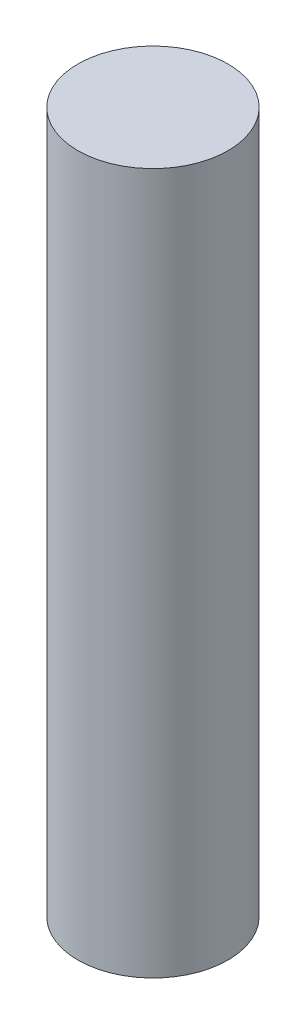
ISO-10303-21;
HEADER;
FILE_DESCRIPTION(('STEP AP214'),'2;1');
FILE_NAME('part.step','',(''),(''),'','','');
FILE_SCHEMA(('AUTOMOTIVE_DESIGN { 1 0 10303 214 1 1 1 1 }'));
ENDSEC;
DATA;
#1=APPLICATION_CONTEXT('core data for automotive mechanical design processes');
#2=APPLICATION_PROTOCOL_DEFINITION('international standard','automotive_design',2000,#1);
#3=PRODUCT_CONTEXT('',#1,'mechanical');
#4=PRODUCT('Part','Part','',(#3));
#5=PRODUCT_RELATED_PRODUCT_CATEGORY('part','',(#4));
#6=PRODUCT_DEFINITION_FORMATION('','',#4);
#7=PRODUCT_DEFINITION_CONTEXT('part definition',#1,'design');
#8=PRODUCT_DEFINITION('design','',#6,#7);
#9=PRODUCT_DEFINITION_SHAPE('','',#8);
#10=(LENGTH_UNIT() NAMED_UNIT(*) SI_UNIT(.MILLI.,.METRE.));
#11=(NAMED_UNIT(*) PLANE_ANGLE_UNIT() SI_UNIT($,.RADIAN.));
#12=(NAMED_UNIT(*) SI_UNIT($,.STERADIAN.) SOLID_ANGLE_UNIT());
#13=UNCERTAINTY_MEASURE_WITH_UNIT(LENGTH_MEASURE(1.E-05),#10,'distance_accuracy_value','');
#14=(GEOMETRIC_REPRESENTATION_CONTEXT(3) GLOBAL_UNCERTAINTY_ASSIGNED_CONTEXT((#13)) GLOBAL_UNIT_ASSIGNED_CONTEXT((#10,
#11,#12)) REPRESENTATION_CONTEXT('',''));
#15=CARTESIAN_POINT('',(0.,0.,0.));
#16=DIRECTION('',(0.,0.,1.));
#17=DIRECTION('',(1.,0.,0.));
#18=AXIS2_PLACEMENT_3D('',#15,#16,#17);
#19=CARTESIAN_POINT('',(0.,612.5,0.));
#20=DIRECTION('',(0.,-1.,0.));
#21=DIRECTION('',(0.,0.,-1.));
#22=AXIS2_PLACEMENT_3D('',#19,#20,#21);
#23=CYLINDRICAL_SURFACE('',#22,56.25);
#24=CARTESIAN_POINT('',(0.,612.5,0.));
#25=DIRECTION('',(0.,1.,0.));
#26=DIRECTION('',(0.,0.,1.));
#27=AXIS2_PLACEMENT_3D('',#24,#25,#26);
#28=CIRCLE('',#27,56.25);
#29=CARTESIAN_POINT('',(0.,612.5,56.25));
#30=VERTEX_POINT('',#29);
#31=EDGE_CURVE('E10',#30,#30,#28,.T.);
#32=ORIENTED_EDGE('',*,*,#31,.F.);
#33=EDGE_LOOP('',(#32));
#34=FACE_BOUND('',#33,.T.);
#35=CARTESIAN_POINT('',(0.,87.5,0.));
#36=DIRECTION('',(0.,1.,0.));
#37=DIRECTION('',(0.,0.,1.));
#38=AXIS2_PLACEMENT_3D('',#35,#36,#37);
#39=CIRCLE('',#38,56.25);
#40=CARTESIAN_POINT('',(0.,87.5,56.25));
#41=VERTEX_POINT('',#40);
#42=EDGE_CURVE('E37',#41,#41,#39,.T.);
#43=ORIENTED_EDGE('',*,*,#42,.T.);
#44=EDGE_LOOP('',(#43));
#45=FACE_BOUND('',#44,.T.);
#46=ADVANCED_FACE('F34',(#34,#45),#23,.T.);
#47=CARTESIAN_POINT('',(0.,612.5,0.));
#48=DIRECTION('',(0.,1.,0.));
#49=DIRECTION('',(0.,0.,1.));
#50=AXIS2_PLACEMENT_3D('',#47,#48,#49);
#51=PLANE('',#50);
#52=ORIENTED_EDGE('',*,*,#31,.T.);
#53=EDGE_LOOP('',(#52));
#54=FACE_BOUND('',#53,.T.);
#55=ADVANCED_FACE('F49',(#54),#51,.T.);
#56=CARTESIAN_POINT('',(0.,87.5,0.));
#57=DIRECTION('',(0.,1.,0.));
#58=DIRECTION('',(0.,0.,1.));
#59=AXIS2_PLACEMENT_3D('',#56,#57,#58);
#60=PLANE('',#59);
#61=ORIENTED_EDGE('',*,*,#42,.F.);
#62=EDGE_LOOP('',(#61));
#63=FACE_BOUND('',#62,.T.);
#64=ADVANCED_FACE('F47',(#63),#60,.F.);
#65=CLOSED_SHELL('',(#46,#55,#64));
#66=MANIFOLD_SOLID_BREP('B2',#65);
#67=ADVANCED_BREP_SHAPE_REPRESENTATION('',(#18,#66),#14);
#68=SHAPE_DEFINITION_REPRESENTATION(#9,#67);
ENDSEC;
END-ISO-10303-21;
